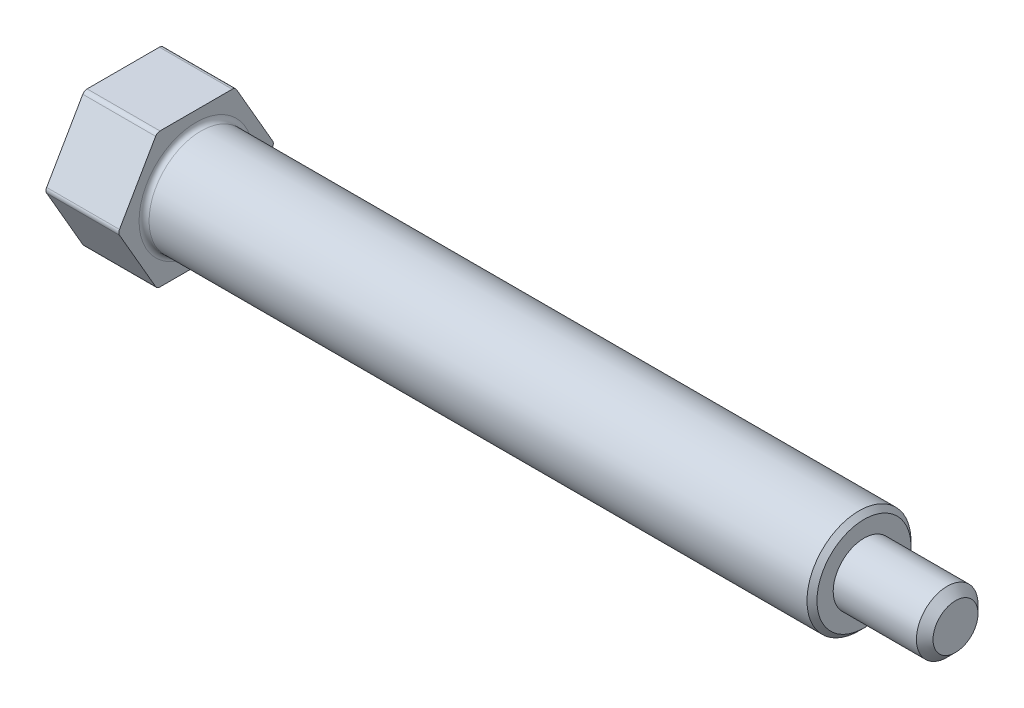
ISO-10303-21;
HEADER;
FILE_DESCRIPTION(('STEP AP214'),'2;1');
FILE_NAME('part.step','',(''),(''),'','','');
FILE_SCHEMA(('AUTOMOTIVE_DESIGN { 1 0 10303 214 1 1 1 1 }'));
ENDSEC;
DATA;
#1=APPLICATION_CONTEXT('core data for automotive mechanical design processes');
#2=APPLICATION_PROTOCOL_DEFINITION('international standard','automotive_design',2000,#1);
#3=PRODUCT_CONTEXT('',#1,'mechanical');
#4=PRODUCT('Part','Part','',(#3));
#5=PRODUCT_RELATED_PRODUCT_CATEGORY('part','',(#4));
#6=PRODUCT_DEFINITION_FORMATION('','',#4);
#7=PRODUCT_DEFINITION_CONTEXT('part definition',#1,'design');
#8=PRODUCT_DEFINITION('design','',#6,#7);
#9=PRODUCT_DEFINITION_SHAPE('','',#8);
#10=(LENGTH_UNIT() NAMED_UNIT(*) SI_UNIT(.MILLI.,.METRE.));
#11=(NAMED_UNIT(*) PLANE_ANGLE_UNIT() SI_UNIT($,.RADIAN.));
#12=(NAMED_UNIT(*) SI_UNIT($,.STERADIAN.) SOLID_ANGLE_UNIT());
#13=UNCERTAINTY_MEASURE_WITH_UNIT(LENGTH_MEASURE(1.E-05),#10,'distance_accuracy_value','');
#14=(GEOMETRIC_REPRESENTATION_CONTEXT(3) GLOBAL_UNCERTAINTY_ASSIGNED_CONTEXT((#13)) GLOBAL_UNIT_ASSIGNED_CONTEXT((#10,
#11,#12)) REPRESENTATION_CONTEXT('',''));
#15=CARTESIAN_POINT('',(0.,0.,0.));
#16=DIRECTION('',(0.,0.,1.));
#17=DIRECTION('',(1.,0.,0.));
#18=AXIS2_PLACEMENT_3D('',#15,#16,#17);
#19=CARTESIAN_POINT('',(-72.5660019940179,0.,0.));
#20=DIRECTION('',(-1.,0.,0.));
#21=DIRECTION('',(0.,0.,1.));
#22=AXIS2_PLACEMENT_3D('',#19,#20,#21);
#23=CYLINDRICAL_SURFACE('',#22,7.93749999999999);
#24=CARTESIAN_POINT('',(11.8745,0.,0.));
#25=DIRECTION('',(-1.,0.,0.));
#26=DIRECTION('',(0.,0.,1.));
#27=AXIS2_PLACEMENT_3D('',#24,#25,#26);
#28=CIRCLE('',#27,7.93749999999999);
#29=CARTESIAN_POINT('',(11.8745,0.,7.93749999999999));
#30=VERTEX_POINT('',#29);
#31=EDGE_CURVE('E12',#30,#30,#28,.F.);
#32=ORIENTED_EDGE('',*,*,#31,.T.);
#33=EDGE_LOOP('',(#32));
#34=FACE_BOUND('',#33,.T.);
#35=CARTESIAN_POINT('',(112.268,0.,0.));
#36=DIRECTION('',(-1.,0.,0.));
#37=DIRECTION('',(0.,0.,1.));
#38=AXIS2_PLACEMENT_3D('',#35,#36,#37);
#39=CIRCLE('',#38,7.93749999999999);
#40=CARTESIAN_POINT('',(112.268,0.,7.93749999999999));
#41=VERTEX_POINT('',#40);
#42=EDGE_CURVE('E212',#41,#41,#39,.T.);
#43=ORIENTED_EDGE('',*,*,#42,.T.);
#44=EDGE_LOOP('',(#43));
#45=FACE_BOUND('',#44,.T.);
#46=ADVANCED_FACE('F46',(#34,#45),#23,.T.);
#47=CARTESIAN_POINT('',(127.,0.,0.));
#48=DIRECTION('',(-1.,0.,0.));
#49=DIRECTION('',(0.,0.,1.));
#50=AXIS2_PLACEMENT_3D('',#47,#48,#49);
#51=PLANE('',#50);
#52=CARTESIAN_POINT('',(127.,0.,0.));
#53=DIRECTION('',(-1.,0.,0.));
#54=DIRECTION('',(0.,0.,1.));
#55=AXIS2_PLACEMENT_3D('',#52,#53,#54);
#56=CIRCLE('',#55,3.42899999999999);
#57=CARTESIAN_POINT('',(127.,0.,3.42899999999999));
#58=VERTEX_POINT('',#57);
#59=EDGE_CURVE('E162',#58,#58,#56,.F.);
#60=ORIENTED_EDGE('',*,*,#59,.T.);
#61=EDGE_LOOP('',(#60));
#62=FACE_BOUND('',#61,.T.);
#63=ADVANCED_FACE('F231',(#62),#51,.F.);
#64=CARTESIAN_POINT('',(-72.5660019940179,0.,0.));
#65=DIRECTION('',(-1.,0.,0.));
#66=DIRECTION('',(0.,0.,1.));
#67=AXIS2_PLACEMENT_3D('',#64,#65,#66);
#68=CYLINDRICAL_SURFACE('',#67,4.699);
#69=CARTESIAN_POINT('',(125.73,0.,0.));
#70=DIRECTION('',(-1.,0.,0.));
#71=DIRECTION('',(0.,0.,1.));
#72=AXIS2_PLACEMENT_3D('',#69,#70,#71);
#73=CIRCLE('',#72,4.699);
#74=CARTESIAN_POINT('',(125.73,0.,4.699));
#75=VERTEX_POINT('',#74);
#76=EDGE_CURVE('E166',#75,#75,#73,.T.);
#77=ORIENTED_EDGE('',*,*,#76,.T.);
#78=EDGE_LOOP('',(#77));
#79=FACE_BOUND('',#78,.T.);
#80=CARTESIAN_POINT('',(113.03,0.,0.));
#81=DIRECTION('',(-1.,0.,0.));
#82=DIRECTION('',(0.,0.,1.));
#83=AXIS2_PLACEMENT_3D('',#80,#81,#82);
#84=CIRCLE('',#83,4.699);
#85=CARTESIAN_POINT('',(113.03,0.,4.699));
#86=VERTEX_POINT('',#85);
#87=EDGE_CURVE('E450',#86,#86,#84,.T.);
#88=ORIENTED_EDGE('',*,*,#87,.F.);
#89=EDGE_LOOP('',(#88));
#90=FACE_BOUND('',#89,.T.);
#91=ADVANCED_FACE('F237',(#79,#90),#68,.T.);
#92=CARTESIAN_POINT('',(113.03,4.699,0.));
#93=DIRECTION('',(-1.,0.,0.));
#94=DIRECTION('',(0.,0.,1.));
#95=AXIS2_PLACEMENT_3D('',#92,#93,#94);
#96=PLANE('',#95);
#97=CARTESIAN_POINT('',(113.03,0.,0.));
#98=DIRECTION('',(-1.,0.,0.));
#99=DIRECTION('',(0.,0.,1.));
#100=AXIS2_PLACEMENT_3D('',#97,#98,#99);
#101=CIRCLE('',#100,7.17550000000003);
#102=CARTESIAN_POINT('',(113.03,0.,7.17550000000003));
#103=VERTEX_POINT('',#102);
#104=EDGE_CURVE('E215',#103,#103,#101,.F.);
#105=ORIENTED_EDGE('',*,*,#104,.T.);
#106=EDGE_LOOP('',(#105));
#107=FACE_BOUND('',#106,.T.);
#108=ORIENTED_EDGE('',*,*,#87,.T.);
#109=EDGE_LOOP('',(#108));
#110=FACE_BOUND('',#109,.T.);
#111=ADVANCED_FACE('F244',(#107,#110),#96,.F.);
#112=CARTESIAN_POINT('',(125.73,0.,0.));
#113=DIRECTION('',(-1.,0.,0.));
#114=DIRECTION('',(0.,0.,1.));
#115=AXIS2_PLACEMENT_3D('',#112,#113,#114);
#116=CONICAL_SURFACE('',#115,4.699,0.785398163397445);
#117=ORIENTED_EDGE('',*,*,#59,.F.);
#118=EDGE_LOOP('',(#117));
#119=FACE_BOUND('',#118,.T.);
#120=ORIENTED_EDGE('',*,*,#76,.F.);
#121=EDGE_LOOP('',(#120));
#122=FACE_BOUND('',#121,.T.);
#123=ADVANCED_FACE('F247',(#119,#122),#116,.T.);
#124=CARTESIAN_POINT('',(11.1125,-10.3124,-5.95386691599109));
#125=DIRECTION('',(0.,-1.,0.));
#126=DIRECTION('',(0.,0.,-1.));
#127=AXIS2_PLACEMENT_3D('',#124,#125,#126);
#128=PLANE('',#127);
#129=DIRECTION('',(0.,0.,1.));
#130=VECTOR('',#129,1.);
#131=CARTESIAN_POINT('',(0.,-10.3124,-5.95386691599109));
#132=LINE('',#131,#130);
#133=CARTESIAN_POINT('',(0.,-10.3124,-5.5139260108686));
#134=VERTEX_POINT('',#133);
#135=CARTESIAN_POINT('',(0.,-10.3124,5.5139260108686));
#136=VERTEX_POINT('',#135);
#137=EDGE_CURVE('E420',#134,#136,#132,.T.);
#138=ORIENTED_EDGE('',*,*,#137,.F.);
#139=DIRECTION('',(-1.,0.,0.));
#140=VECTOR('',#139,1.);
#141=CARTESIAN_POINT('',(11.1125,-10.3124,-5.5139260108686));
#142=LINE('',#141,#140);
#143=CARTESIAN_POINT('',(11.1125,-10.3124,-5.5139260108686));
#144=VERTEX_POINT('',#143);
#145=EDGE_CURVE('E202',#134,#144,#142,.F.);
#146=ORIENTED_EDGE('',*,*,#145,.T.);
#147=DIRECTION('',(0.,0.,1.));
#148=VECTOR('',#147,1.);
#149=CARTESIAN_POINT('',(11.1125,-10.3124,-5.95386691599109));
#150=LINE('',#149,#148);
#151=CARTESIAN_POINT('',(11.1125,-10.3124,5.5139260108686));
#152=VERTEX_POINT('',#151);
#153=EDGE_CURVE('E427',#144,#152,#150,.T.);
#154=ORIENTED_EDGE('',*,*,#153,.T.);
#155=DIRECTION('',(-1.,0.,0.));
#156=VECTOR('',#155,1.);
#157=CARTESIAN_POINT('',(11.1125,-10.3124,5.5139260108686));
#158=LINE('',#157,#156);
#159=EDGE_CURVE('E199',#152,#136,#158,.T.);
#160=ORIENTED_EDGE('',*,*,#159,.T.);
#161=EDGE_LOOP('',(#138,#146,#154,#160));
#162=FACE_BOUND('',#161,.T.);
#163=ADVANCED_FACE('F254',(#162),#128,.T.);
#164=CARTESIAN_POINT('',(11.1125,0.,-11.9077338319822));
#165=DIRECTION('',(0.,-0.5,-0.866025403784438));
#166=DIRECTION('',(0.,0.866025403784439,-0.5));
#167=AXIS2_PLACEMENT_3D('',#164,#165,#166);
#168=PLANE('',#167);
#169=DIRECTION('',(0.,-0.866025403784438,0.5));
#170=VECTOR('',#169,1.);
#171=CARTESIAN_POINT('',(0.,0.,-11.9077338319822));
#172=LINE('',#171,#170);
#173=CARTESIAN_POINT('',(0.,-0.381000000000001,-11.6877633794209));
#174=VERTEX_POINT('',#173);
#175=CARTESIAN_POINT('',(0.,-9.9314,-6.17383736855234));
#176=VERTEX_POINT('',#175);
#177=EDGE_CURVE('E433',#174,#176,#172,.T.);
#178=ORIENTED_EDGE('',*,*,#177,.F.);
#179=DIRECTION('',(-1.,0.,0.));
#180=VECTOR('',#179,1.);
#181=CARTESIAN_POINT('',(11.1125,-0.381000000000001,-11.6877633794209));
#182=LINE('',#181,#180);
#183=CARTESIAN_POINT('',(11.1125,-0.381000000000001,-11.6877633794209));
#184=VERTEX_POINT('',#183);
#185=EDGE_CURVE('E197',#174,#184,#182,.F.);
#186=ORIENTED_EDGE('',*,*,#185,.T.);
#187=DIRECTION('',(0.,-0.866025403784438,0.5));
#188=VECTOR('',#187,1.);
#189=CARTESIAN_POINT('',(11.1125,0.,-11.9077338319822));
#190=LINE('',#189,#188);
#191=CARTESIAN_POINT('',(11.1125,-9.9314,-6.17383736855234));
#192=VERTEX_POINT('',#191);
#193=EDGE_CURVE('E447',#184,#192,#190,.T.);
#194=ORIENTED_EDGE('',*,*,#193,.T.);
#195=DIRECTION('',(-1.,0.,0.));
#196=VECTOR('',#195,1.);
#197=CARTESIAN_POINT('',(11.1125,-9.9314,-6.17383736855234));
#198=LINE('',#197,#196);
#199=EDGE_CURVE('E194',#192,#176,#198,.T.);
#200=ORIENTED_EDGE('',*,*,#199,.T.);
#201=EDGE_LOOP('',(#178,#186,#194,#200));
#202=FACE_BOUND('',#201,.T.);
#203=ADVANCED_FACE('F373',(#202),#168,.T.);
#204=CARTESIAN_POINT('',(11.1125,10.3124,-5.9538669159911));
#205=DIRECTION('',(0.,0.5,-0.866025403784439));
#206=DIRECTION('',(0.,0.866025403784439,0.5));
#207=AXIS2_PLACEMENT_3D('',#204,#205,#206);
#208=PLANE('',#207);
#209=DIRECTION('',(0.,-0.866025403784438,-0.5));
#210=VECTOR('',#209,1.);
#211=CARTESIAN_POINT('',(0.,10.3124,-5.9538669159911));
#212=LINE('',#211,#210);
#213=CARTESIAN_POINT('',(0.,9.9314,-6.17383736855234));
#214=VERTEX_POINT('',#213);
#215=CARTESIAN_POINT('',(0.,0.381000000000003,-11.6877633794209));
#216=VERTEX_POINT('',#215);
#217=EDGE_CURVE('E157',#214,#216,#212,.T.);
#218=ORIENTED_EDGE('',*,*,#217,.F.);
#219=DIRECTION('',(-1.,0.,0.));
#220=VECTOR('',#219,1.);
#221=CARTESIAN_POINT('',(11.1125,9.9314,-6.17383736855234));
#222=LINE('',#221,#220);
#223=CARTESIAN_POINT('',(11.1125,9.9314,-6.17383736855234));
#224=VERTEX_POINT('',#223);
#225=EDGE_CURVE('E182',#214,#224,#222,.F.);
#226=ORIENTED_EDGE('',*,*,#225,.T.);
#227=DIRECTION('',(0.,-0.866025403784438,-0.5));
#228=VECTOR('',#227,1.);
#229=CARTESIAN_POINT('',(11.1125,10.3124,-5.9538669159911));
#230=LINE('',#229,#228);
#231=CARTESIAN_POINT('',(11.1125,0.381000000000003,-11.6877633794209));
#232=VERTEX_POINT('',#231);
#233=EDGE_CURVE('E444',#224,#232,#230,.T.);
#234=ORIENTED_EDGE('',*,*,#233,.T.);
#235=DIRECTION('',(-1.,0.,0.));
#236=VECTOR('',#235,1.);
#237=CARTESIAN_POINT('',(11.1125,0.380999999999999,-11.6877633794209));
#238=LINE('',#237,#236);
#239=EDGE_CURVE('E179',#232,#216,#238,.T.);
#240=ORIENTED_EDGE('',*,*,#239,.T.);
#241=EDGE_LOOP('',(#218,#226,#234,#240));
#242=FACE_BOUND('',#241,.T.);
#243=ADVANCED_FACE('F382',(#242),#208,.T.);
#244=CARTESIAN_POINT('',(11.1125,10.3124,5.95386691599109));
#245=DIRECTION('',(0.,1.,0.));
#246=DIRECTION('',(0.,0.,1.));
#247=AXIS2_PLACEMENT_3D('',#244,#245,#246);
#248=PLANE('',#247);
#249=DIRECTION('',(0.,0.,-1.));
#250=VECTOR('',#249,1.);
#251=CARTESIAN_POINT('',(11.1125,10.3124,5.95386691599109));
#252=LINE('',#251,#250);
#253=CARTESIAN_POINT('',(11.1125,10.3124,5.5139260108686));
#254=VERTEX_POINT('',#253);
#255=CARTESIAN_POINT('',(11.1125,10.3124,-5.5139260108686));
#256=VERTEX_POINT('',#255);
#257=EDGE_CURVE('E442',#254,#256,#252,.T.);
#258=ORIENTED_EDGE('',*,*,#257,.T.);
#259=DIRECTION('',(-1.,0.,0.));
#260=VECTOR('',#259,1.);
#261=CARTESIAN_POINT('',(11.1125,10.3124,-5.5139260108686));
#262=LINE('',#261,#260);
#263=CARTESIAN_POINT('',(0.,10.3124,-5.5139260108686));
#264=VERTEX_POINT('',#263);
#265=EDGE_CURVE('E148',#256,#264,#262,.T.);
#266=ORIENTED_EDGE('',*,*,#265,.T.);
#267=DIRECTION('',(0.,0.,-1.));
#268=VECTOR('',#267,1.);
#269=CARTESIAN_POINT('',(0.,10.3124,5.95386691599109));
#270=LINE('',#269,#268);
#271=CARTESIAN_POINT('',(0.,10.3124,5.5139260108686));
#272=VERTEX_POINT('',#271);
#273=EDGE_CURVE('E140',#272,#264,#270,.T.);
#274=ORIENTED_EDGE('',*,*,#273,.F.);
#275=DIRECTION('',(-1.,0.,0.));
#276=VECTOR('',#275,1.);
#277=CARTESIAN_POINT('',(11.1125,10.3124,5.5139260108686));
#278=LINE('',#277,#276);
#279=EDGE_CURVE('E154',#272,#254,#278,.F.);
#280=ORIENTED_EDGE('',*,*,#279,.T.);
#281=EDGE_LOOP('',(#258,#266,#274,#280));
#282=FACE_BOUND('',#281,.T.);
#283=ADVANCED_FACE('F153',(#282),#248,.T.);
#284=CARTESIAN_POINT('',(11.1125,0.,11.9077338319822));
#285=DIRECTION('',(0.,0.5,0.866025403784438));
#286=DIRECTION('',(0.,-0.866025403784439,0.5));
#287=AXIS2_PLACEMENT_3D('',#284,#285,#286);
#288=PLANE('',#287);
#289=DIRECTION('',(0.,0.866025403784439,-0.5));
#290=VECTOR('',#289,1.);
#291=CARTESIAN_POINT('',(0.,0.,11.9077338319822));
#292=LINE('',#291,#290);
#293=CARTESIAN_POINT('',(0.,0.381000000000005,11.6877633794209));
#294=VERTEX_POINT('',#293);
#295=CARTESIAN_POINT('',(0.,9.9314,6.17383736855234));
#296=VERTEX_POINT('',#295);
#297=EDGE_CURVE('E142',#294,#296,#292,.T.);
#298=ORIENTED_EDGE('',*,*,#297,.F.);
#299=DIRECTION('',(-1.,0.,0.));
#300=VECTOR('',#299,1.);
#301=CARTESIAN_POINT('',(11.1125,0.381000000000005,11.6877633794209));
#302=LINE('',#301,#300);
#303=CARTESIAN_POINT('',(11.1125,0.381000000000005,11.6877633794209));
#304=VERTEX_POINT('',#303);
#305=EDGE_CURVE('E210',#294,#304,#302,.F.);
#306=ORIENTED_EDGE('',*,*,#305,.T.);
#307=DIRECTION('',(0.,0.866025403784439,-0.5));
#308=VECTOR('',#307,1.);
#309=CARTESIAN_POINT('',(11.1125,0.,11.9077338319822));
#310=LINE('',#309,#308);
#311=CARTESIAN_POINT('',(11.1125,9.9314,6.17383736855234));
#312=VERTEX_POINT('',#311);
#313=EDGE_CURVE('E435',#304,#312,#310,.T.);
#314=ORIENTED_EDGE('',*,*,#313,.T.);
#315=DIRECTION('',(-1.,0.,0.));
#316=VECTOR('',#315,1.);
#317=CARTESIAN_POINT('',(11.1125,9.9314,6.17383736855234));
#318=LINE('',#317,#316);
#319=EDGE_CURVE('E208',#312,#296,#318,.T.);
#320=ORIENTED_EDGE('',*,*,#319,.T.);
#321=EDGE_LOOP('',(#298,#306,#314,#320));
#322=FACE_BOUND('',#321,.T.);
#323=ADVANCED_FACE('F401',(#322),#288,.T.);
#324=CARTESIAN_POINT('',(11.1125,-10.3124,5.9538669159911));
#325=DIRECTION('',(0.,-0.5,0.866025403784439));
#326=DIRECTION('',(0.,-0.866025403784439,-0.5));
#327=AXIS2_PLACEMENT_3D('',#324,#325,#326);
#328=PLANE('',#327);
#329=DIRECTION('',(0.,0.866025403784439,0.5));
#330=VECTOR('',#329,1.);
#331=CARTESIAN_POINT('',(0.,-10.3124,5.9538669159911));
#332=LINE('',#331,#330);
#333=CARTESIAN_POINT('',(0.,-9.9314,6.17383736855234));
#334=VERTEX_POINT('',#333);
#335=CARTESIAN_POINT('',(0.,-0.380999999999994,11.6877633794209));
#336=VERTEX_POINT('',#335);
#337=EDGE_CURVE('E418',#334,#336,#332,.T.);
#338=ORIENTED_EDGE('',*,*,#337,.F.);
#339=DIRECTION('',(-1.,0.,0.));
#340=VECTOR('',#339,1.);
#341=CARTESIAN_POINT('',(11.1125,-9.9314,6.17383736855234));
#342=LINE('',#341,#340);
#343=CARTESIAN_POINT('',(11.1125,-9.9314,6.17383736855234));
#344=VERTEX_POINT('',#343);
#345=EDGE_CURVE('E68',#334,#344,#342,.F.);
#346=ORIENTED_EDGE('',*,*,#345,.T.);
#347=DIRECTION('',(0.,0.866025403784439,0.5));
#348=VECTOR('',#347,1.);
#349=CARTESIAN_POINT('',(11.1125,-10.3124,5.9538669159911));
#350=LINE('',#349,#348);
#351=CARTESIAN_POINT('',(11.1125,-0.380999999999994,11.6877633794209));
#352=VERTEX_POINT('',#351);
#353=EDGE_CURVE('E429',#344,#352,#350,.T.);
#354=ORIENTED_EDGE('',*,*,#353,.T.);
#355=DIRECTION('',(-1.,0.,0.));
#356=VECTOR('',#355,1.);
#357=CARTESIAN_POINT('',(11.1125,-0.380999999999992,11.6877633794209));
#358=LINE('',#357,#356);
#359=EDGE_CURVE('E204',#352,#336,#358,.T.);
#360=ORIENTED_EDGE('',*,*,#359,.T.);
#361=EDGE_LOOP('',(#338,#346,#354,#360));
#362=FACE_BOUND('',#361,.T.);
#363=ADVANCED_FACE('F305',(#362),#328,.T.);
#364=CARTESIAN_POINT('',(11.1125,-10.3124,5.9538669159911));
#365=DIRECTION('',(-1.,0.,0.));
#366=DIRECTION('',(0.,0.,1.));
#367=AXIS2_PLACEMENT_3D('',#364,#365,#366);
#368=PLANE('',#367);
#369=CARTESIAN_POINT('',(11.1125,0.,0.));
#370=DIRECTION('',(-1.,0.,0.));
#371=DIRECTION('',(0.,0.,1.));
#372=AXIS2_PLACEMENT_3D('',#369,#370,#371);
#373=CIRCLE('',#372,8.69949999999999);
#374=CARTESIAN_POINT('',(11.1125,0.,8.69949999999999));
#375=VERTEX_POINT('',#374);
#376=EDGE_CURVE('E54',#375,#375,#373,.T.);
#377=ORIENTED_EDGE('',*,*,#376,.T.);
#378=EDGE_LOOP('',(#377));
#379=FACE_BOUND('',#378,.T.);
#380=ORIENTED_EDGE('',*,*,#233,.F.);
#381=CARTESIAN_POINT('',(11.1125,9.5504,-5.5139260108686));
#382=DIRECTION('',(-1.,0.,0.));
#383=DIRECTION('',(0.,0.,1.));
#384=AXIS2_PLACEMENT_3D('',#381,#382,#383);
#385=CIRCLE('',#384,0.762);
#386=EDGE_CURVE('E192',#224,#256,#385,.F.);
#387=ORIENTED_EDGE('',*,*,#386,.T.);
#388=ORIENTED_EDGE('',*,*,#257,.F.);
#389=CARTESIAN_POINT('',(11.1125,9.5504,5.5139260108686));
#390=DIRECTION('',(-1.,0.,0.));
#391=DIRECTION('',(0.,0.,1.));
#392=AXIS2_PLACEMENT_3D('',#389,#390,#391);
#393=CIRCLE('',#392,0.762);
#394=EDGE_CURVE('E161',#254,#312,#393,.F.);
#395=ORIENTED_EDGE('',*,*,#394,.T.);
#396=ORIENTED_EDGE('',*,*,#313,.F.);
#397=CARTESIAN_POINT('',(11.1125,0.,11.0278520217372));
#398=DIRECTION('',(-1.,0.,0.));
#399=DIRECTION('',(0.,0.,1.));
#400=AXIS2_PLACEMENT_3D('',#397,#398,#399);
#401=CIRCLE('',#400,0.762);
#402=EDGE_CURVE('E61',#304,#352,#401,.F.);
#403=ORIENTED_EDGE('',*,*,#402,.T.);
#404=ORIENTED_EDGE('',*,*,#353,.F.);
#405=CARTESIAN_POINT('',(11.1125,-9.5504,5.5139260108686));
#406=DIRECTION('',(-1.,0.,0.));
#407=DIRECTION('',(0.,0.,1.));
#408=AXIS2_PLACEMENT_3D('',#405,#406,#407);
#409=CIRCLE('',#408,0.762);
#410=EDGE_CURVE('E186',#344,#152,#409,.F.);
#411=ORIENTED_EDGE('',*,*,#410,.T.);
#412=ORIENTED_EDGE('',*,*,#153,.F.);
#413=CARTESIAN_POINT('',(11.1125,-9.5504,-5.5139260108686));
#414=DIRECTION('',(-1.,0.,0.));
#415=DIRECTION('',(0.,0.,1.));
#416=AXIS2_PLACEMENT_3D('',#413,#414,#415);
#417=CIRCLE('',#416,0.762);
#418=EDGE_CURVE('E188',#144,#192,#417,.F.);
#419=ORIENTED_EDGE('',*,*,#418,.T.);
#420=ORIENTED_EDGE('',*,*,#193,.F.);
#421=CARTESIAN_POINT('',(11.1125,0.,-11.0278520217372));
#422=DIRECTION('',(-1.,0.,0.));
#423=DIRECTION('',(0.,0.,1.));
#424=AXIS2_PLACEMENT_3D('',#421,#422,#423);
#425=CIRCLE('',#424,0.762);
#426=EDGE_CURVE('E190',#184,#232,#425,.F.);
#427=ORIENTED_EDGE('',*,*,#426,.T.);
#428=EDGE_LOOP('',(#380,#387,#388,#395,#396,#403,#404,#411,#412,#419,#420,#427));
#429=FACE_BOUND('',#428,.T.);
#430=ADVANCED_FACE('F220',(#379,#429),#368,.F.);
#431=CARTESIAN_POINT('',(0.,7.93749999999999,0.));
#432=DIRECTION('',(1.,0.,0.));
#433=DIRECTION('',(0.,0.,-1.));
#434=AXIS2_PLACEMENT_3D('',#431,#432,#433);
#435=PLANE('',#434);
#436=ORIENTED_EDGE('',*,*,#273,.T.);
#437=CARTESIAN_POINT('',(0.,9.5504,-5.5139260108686));
#438=DIRECTION('',(1.,0.,0.));
#439=DIRECTION('',(0.,0.,-1.));
#440=AXIS2_PLACEMENT_3D('',#437,#438,#439);
#441=CIRCLE('',#440,0.762);
#442=EDGE_CURVE('E177',#264,#214,#441,.F.);
#443=ORIENTED_EDGE('',*,*,#442,.T.);
#444=ORIENTED_EDGE('',*,*,#217,.T.);
#445=CARTESIAN_POINT('',(0.,0.,-11.0278520217372));
#446=DIRECTION('',(1.,0.,0.));
#447=DIRECTION('',(0.,0.,-1.));
#448=AXIS2_PLACEMENT_3D('',#445,#446,#447);
#449=CIRCLE('',#448,0.762);
#450=EDGE_CURVE('E175',#216,#174,#449,.F.);
#451=ORIENTED_EDGE('',*,*,#450,.T.);
#452=ORIENTED_EDGE('',*,*,#177,.T.);
#453=CARTESIAN_POINT('',(0.,-9.5504,-5.5139260108686));
#454=DIRECTION('',(1.,0.,0.));
#455=DIRECTION('',(0.,0.,-1.));
#456=AXIS2_PLACEMENT_3D('',#453,#454,#455);
#457=CIRCLE('',#456,0.762);
#458=EDGE_CURVE('E173',#176,#134,#457,.F.);
#459=ORIENTED_EDGE('',*,*,#458,.T.);
#460=ORIENTED_EDGE('',*,*,#137,.T.);
#461=CARTESIAN_POINT('',(0.,-9.5504,5.5139260108686));
#462=DIRECTION('',(1.,0.,0.));
#463=DIRECTION('',(0.,0.,-1.));
#464=AXIS2_PLACEMENT_3D('',#461,#462,#463);
#465=CIRCLE('',#464,0.762);
#466=EDGE_CURVE('E171',#136,#334,#465,.F.);
#467=ORIENTED_EDGE('',*,*,#466,.T.);
#468=ORIENTED_EDGE('',*,*,#337,.T.);
#469=CARTESIAN_POINT('',(0.,0.,11.0278520217372));
#470=DIRECTION('',(1.,0.,0.));
#471=DIRECTION('',(0.,0.,-1.));
#472=AXIS2_PLACEMENT_3D('',#469,#470,#471);
#473=CIRCLE('',#472,0.762);
#474=EDGE_CURVE('E147',#336,#294,#473,.F.);
#475=ORIENTED_EDGE('',*,*,#474,.T.);
#476=ORIENTED_EDGE('',*,*,#297,.T.);
#477=CARTESIAN_POINT('',(0.,9.5504,5.5139260108686));
#478=DIRECTION('',(1.,0.,0.));
#479=DIRECTION('',(0.,0.,-1.));
#480=AXIS2_PLACEMENT_3D('',#477,#478,#479);
#481=CIRCLE('',#480,0.762);
#482=EDGE_CURVE('E137',#296,#272,#481,.F.);
#483=ORIENTED_EDGE('',*,*,#482,.T.);
#484=EDGE_LOOP('',(#436,#443,#444,#451,#452,#459,#460,#467,#468,#475,#476,#483));
#485=FACE_BOUND('',#484,.T.);
#486=ADVANCED_FACE('F139',(#485),#435,.F.);
#487=CARTESIAN_POINT('',(11.1125,9.5504,-5.5139260108686));
#488=DIRECTION('',(-1.,0.,0.));
#489=DIRECTION('',(0.,0.,1.));
#490=AXIS2_PLACEMENT_3D('',#487,#488,#489);
#491=CYLINDRICAL_SURFACE('',#490,0.762);
#492=ORIENTED_EDGE('',*,*,#386,.F.);
#493=ORIENTED_EDGE('',*,*,#225,.F.);
#494=ORIENTED_EDGE('',*,*,#442,.F.);
#495=ORIENTED_EDGE('',*,*,#265,.F.);
#496=EDGE_LOOP('',(#492,#493,#494,#495));
#497=FACE_BOUND('',#496,.T.);
#498=ADVANCED_FACE('F256',(#497),#491,.T.);
#499=CARTESIAN_POINT('',(11.1125,0.,-11.0278520217372));
#500=DIRECTION('',(-1.,0.,0.));
#501=DIRECTION('',(0.,0.,1.));
#502=AXIS2_PLACEMENT_3D('',#499,#500,#501);
#503=CYLINDRICAL_SURFACE('',#502,0.762);
#504=ORIENTED_EDGE('',*,*,#426,.F.);
#505=ORIENTED_EDGE('',*,*,#185,.F.);
#506=ORIENTED_EDGE('',*,*,#450,.F.);
#507=ORIENTED_EDGE('',*,*,#239,.F.);
#508=EDGE_LOOP('',(#504,#505,#506,#507));
#509=FACE_BOUND('',#508,.T.);
#510=ADVANCED_FACE('F259',(#509),#503,.T.);
#511=CARTESIAN_POINT('',(11.1125,-9.5504,-5.5139260108686));
#512=DIRECTION('',(-1.,0.,0.));
#513=DIRECTION('',(0.,0.,1.));
#514=AXIS2_PLACEMENT_3D('',#511,#512,#513);
#515=CYLINDRICAL_SURFACE('',#514,0.762);
#516=ORIENTED_EDGE('',*,*,#418,.F.);
#517=ORIENTED_EDGE('',*,*,#145,.F.);
#518=ORIENTED_EDGE('',*,*,#458,.F.);
#519=ORIENTED_EDGE('',*,*,#199,.F.);
#520=EDGE_LOOP('',(#516,#517,#518,#519));
#521=FACE_BOUND('',#520,.T.);
#522=ADVANCED_FACE('F263',(#521),#515,.T.);
#523=CARTESIAN_POINT('',(11.1125,-9.5504,5.5139260108686));
#524=DIRECTION('',(-1.,0.,0.));
#525=DIRECTION('',(0.,0.,1.));
#526=AXIS2_PLACEMENT_3D('',#523,#524,#525);
#527=CYLINDRICAL_SURFACE('',#526,0.762);
#528=ORIENTED_EDGE('',*,*,#410,.F.);
#529=ORIENTED_EDGE('',*,*,#345,.F.);
#530=ORIENTED_EDGE('',*,*,#466,.F.);
#531=ORIENTED_EDGE('',*,*,#159,.F.);
#532=EDGE_LOOP('',(#528,#529,#530,#531));
#533=FACE_BOUND('',#532,.T.);
#534=ADVANCED_FACE('F267',(#533),#527,.T.);
#535=CARTESIAN_POINT('',(11.1125,0.,11.0278520217372));
#536=DIRECTION('',(-1.,0.,0.));
#537=DIRECTION('',(0.,0.,1.));
#538=AXIS2_PLACEMENT_3D('',#535,#536,#537);
#539=CYLINDRICAL_SURFACE('',#538,0.762);
#540=ORIENTED_EDGE('',*,*,#402,.F.);
#541=ORIENTED_EDGE('',*,*,#305,.F.);
#542=ORIENTED_EDGE('',*,*,#474,.F.);
#543=ORIENTED_EDGE('',*,*,#359,.F.);
#544=EDGE_LOOP('',(#540,#541,#542,#543));
#545=FACE_BOUND('',#544,.T.);
#546=ADVANCED_FACE('F271',(#545),#539,.T.);
#547=CARTESIAN_POINT('',(11.1125,9.5504,5.5139260108686));
#548=DIRECTION('',(-1.,0.,0.));
#549=DIRECTION('',(0.,0.,1.));
#550=AXIS2_PLACEMENT_3D('',#547,#548,#549);
#551=CYLINDRICAL_SURFACE('',#550,0.762);
#552=ORIENTED_EDGE('',*,*,#394,.F.);
#553=ORIENTED_EDGE('',*,*,#279,.F.);
#554=ORIENTED_EDGE('',*,*,#482,.F.);
#555=ORIENTED_EDGE('',*,*,#319,.F.);
#556=EDGE_LOOP('',(#552,#553,#554,#555));
#557=FACE_BOUND('',#556,.T.);
#558=ADVANCED_FACE('F160',(#557),#551,.T.);
#559=CARTESIAN_POINT('',(112.268,0.,0.));
#560=DIRECTION('',(-1.,0.,0.));
#561=DIRECTION('',(0.,0.,1.));
#562=AXIS2_PLACEMENT_3D('',#559,#560,#561);
#563=CONICAL_SURFACE('',#562,7.93749999999999,0.785398163397462);
#564=ORIENTED_EDGE('',*,*,#104,.F.);
#565=EDGE_LOOP('',(#564));
#566=FACE_BOUND('',#565,.T.);
#567=ORIENTED_EDGE('',*,*,#42,.F.);
#568=EDGE_LOOP('',(#567));
#569=FACE_BOUND('',#568,.T.);
#570=ADVANCED_FACE('F223',(#566,#569),#563,.T.);
#571=CARTESIAN_POINT('',(11.8745,0.,0.));
#572=DIRECTION('',(-1.,0.,0.));
#573=DIRECTION('',(0.,0.,1.));
#574=AXIS2_PLACEMENT_3D('',#571,#572,#573);
#575=TOROIDAL_SURFACE('',#574,8.69949999999999,0.762);
#576=ORIENTED_EDGE('',*,*,#31,.F.);
#577=EDGE_LOOP('',(#576));
#578=FACE_BOUND('',#577,.T.);
#579=ORIENTED_EDGE('',*,*,#376,.F.);
#580=EDGE_LOOP('',(#579));
#581=FACE_BOUND('',#580,.T.);
#582=ADVANCED_FACE('F48',(#578,#581),#575,.F.);
#583=CLOSED_SHELL('',(#46,#63,#91,#111,#123,#163,#203,#243,#283,#323,#363,#430,#486,#498,#510,
#522,#534,#546,#558,#570,#582));
#584=MANIFOLD_SOLID_BREP('B2',#583);
#585=ADVANCED_BREP_SHAPE_REPRESENTATION('',(#18,#584),#14);
#586=SHAPE_DEFINITION_REPRESENTATION(#9,#585);
ENDSEC;
END-ISO-10303-21;
